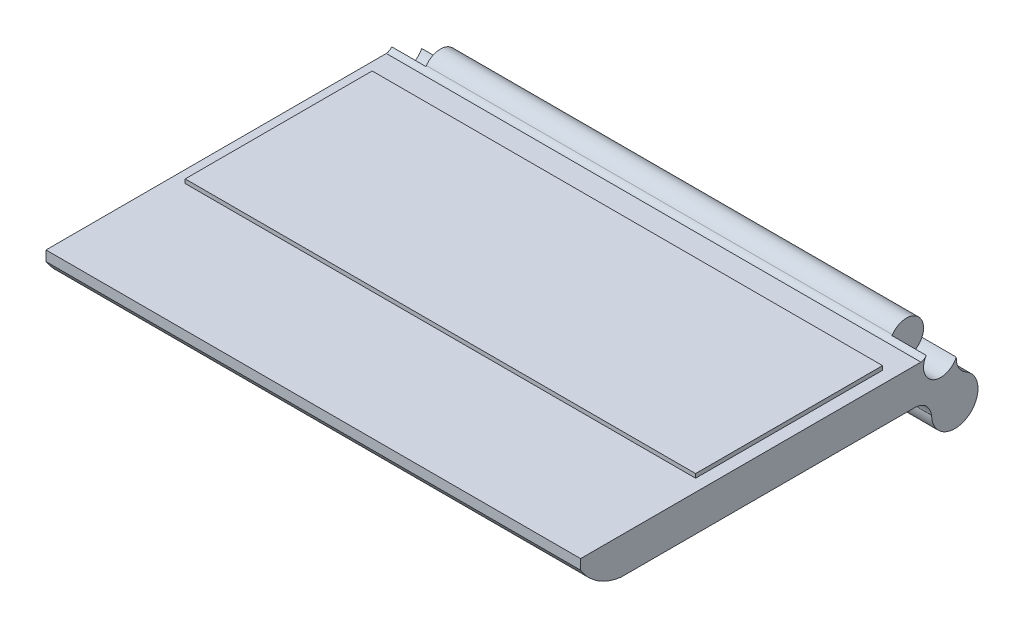
ISO-10303-21;
HEADER;
FILE_DESCRIPTION(('STEP AP214'),'2;1');
FILE_NAME('part.step','',(''),(''),'','','');
FILE_SCHEMA(('AUTOMOTIVE_DESIGN { 1 0 10303 214 1 1 1 1 }'));
ENDSEC;
DATA;
#1=APPLICATION_CONTEXT('core data for automotive mechanical design processes');
#2=APPLICATION_PROTOCOL_DEFINITION('international standard','automotive_design',2000,#1);
#3=PRODUCT_CONTEXT('',#1,'mechanical');
#4=PRODUCT('Part','Part','',(#3));
#5=PRODUCT_RELATED_PRODUCT_CATEGORY('part','',(#4));
#6=PRODUCT_DEFINITION_FORMATION('','',#4);
#7=PRODUCT_DEFINITION_CONTEXT('part definition',#1,'design');
#8=PRODUCT_DEFINITION('design','',#6,#7);
#9=PRODUCT_DEFINITION_SHAPE('','',#8);
#10=(LENGTH_UNIT() NAMED_UNIT(*) SI_UNIT(.MILLI.,.METRE.));
#11=(NAMED_UNIT(*) PLANE_ANGLE_UNIT() SI_UNIT($,.RADIAN.));
#12=(NAMED_UNIT(*) SI_UNIT($,.STERADIAN.) SOLID_ANGLE_UNIT());
#13=UNCERTAINTY_MEASURE_WITH_UNIT(LENGTH_MEASURE(1.E-05),#10,'distance_accuracy_value','');
#14=(GEOMETRIC_REPRESENTATION_CONTEXT(3) GLOBAL_UNCERTAINTY_ASSIGNED_CONTEXT((#13)) GLOBAL_UNIT_ASSIGNED_CONTEXT((#10,
#11,#12)) REPRESENTATION_CONTEXT('',''));
#15=CARTESIAN_POINT('',(0.,0.,0.));
#16=DIRECTION('',(0.,0.,1.));
#17=DIRECTION('',(1.,0.,0.));
#18=AXIS2_PLACEMENT_3D('',#15,#16,#17);
#19=CARTESIAN_POINT('',(132.5,15.,-93.5));
#20=DIRECTION('',(-1.,0.,0.));
#21=DIRECTION('',(0.,0.,1.));
#22=AXIS2_PLACEMENT_3D('',#19,#20,#21);
#23=CYLINDRICAL_SURFACE('',#22,8.50000000000001);
#24=DIRECTION('',(-1.,0.,0.));
#25=VECTOR('',#24,1.);
#26=CARTESIAN_POINT('',(132.5,19.8783276679257,-86.5392587201972));
#27=LINE('',#26,#25);
#28=CARTESIAN_POINT('',(115.5,19.8783276679257,-86.5392587201972));
#29=VERTEX_POINT('',#28);
#30=CARTESIAN_POINT('',(-115.5,19.8783276679257,-86.5392587201972));
#31=VERTEX_POINT('',#30);
#32=EDGE_CURVE('E179',#29,#31,#27,.T.);
#33=ORIENTED_EDGE('',*,*,#32,.F.);
#34=CARTESIAN_POINT('',(115.5,15.,-93.5));
#35=DIRECTION('',(-1.,0.,0.));
#36=DIRECTION('',(0.,0.,1.));
#37=AXIS2_PLACEMENT_3D('',#34,#35,#36);
#38=CIRCLE('',#37,8.50000000000001);
#39=CARTESIAN_POINT('',(115.5,11.408094152009,-101.203779097246));
#40=VERTEX_POINT('',#39);
#41=EDGE_CURVE('E390',#29,#40,#38,.T.);
#42=ORIENTED_EDGE('',*,*,#41,.T.);
#43=DIRECTION('',(-1.,0.,0.));
#44=VECTOR('',#43,1.);
#45=CARTESIAN_POINT('',(132.5,11.408094152009,-101.203779097246));
#46=LINE('',#45,#44);
#47=CARTESIAN_POINT('',(-115.5,11.408094152009,-101.203779097246));
#48=VERTEX_POINT('',#47);
#49=EDGE_CURVE('E52',#40,#48,#46,.T.);
#50=ORIENTED_EDGE('',*,*,#49,.T.);
#51=CARTESIAN_POINT('',(-115.5,15.,-93.5));
#52=DIRECTION('',(-1.,0.,0.));
#53=DIRECTION('',(0.,0.,1.));
#54=AXIS2_PLACEMENT_3D('',#51,#52,#53);
#55=CIRCLE('',#54,8.50000000000001);
#56=EDGE_CURVE('E391',#31,#48,#55,.T.);
#57=ORIENTED_EDGE('',*,*,#56,.F.);
#58=EDGE_LOOP('',(#33,#42,#50,#57));
#59=FACE_BOUND('',#58,.T.);
#60=ADVANCED_FACE('F33',(#59),#23,.T.);
#61=CARTESIAN_POINT('',(132.5,18.,85.));
#62=DIRECTION('',(-1.,0.,0.));
#63=DIRECTION('',(0.,0.,1.));
#64=AXIS2_PLACEMENT_3D('',#61,#62,#63);
#65=PLANE('',#64);
#66=CARTESIAN_POINT('',(132.5,15.,-93.5));
#67=DIRECTION('',(-1.,0.,0.));
#68=DIRECTION('',(0.,0.,1.));
#69=AXIS2_PLACEMENT_3D('',#66,#67,#68);
#70=CIRCLE('',#69,8.50000000000001);
#71=CARTESIAN_POINT('',(132.5,11.408094152009,-101.203779097246));
#72=VERTEX_POINT('',#71);
#73=CARTESIAN_POINT('',(132.5,19.5684800421352,-86.3320860702285));
#74=VERTEX_POINT('',#73);
#75=EDGE_CURVE('E153',#72,#74,#70,.T.);
#76=ORIENTED_EDGE('',*,*,#75,.T.);
#77=CARTESIAN_POINT('',(132.5,19.8783276679257,-86.5392587201972));
#78=CARTESIAN_POINT('',(132.5,17.7202429654045,-85.2085533477742));
#79=CARTESIAN_POINT('',(132.5,18.,-82.512998719724));
#80=B_SPLINE_CURVE_WITH_KNOTS('',2,(#77,#78,#79),.UNSPECIFIED.,.F.,.F.,(3,3),(0.,1.),.UNSPECIFIED.);
#81=CARTESIAN_POINT('',(132.5,18.,-83.6784287243484));
#82=VERTEX_POINT('',#81);
#83=EDGE_CURVE('E166',#74,#82,#80,.T.);
#84=ORIENTED_EDGE('',*,*,#83,.T.);
#85=DIRECTION('',(0.,0.,-1.));
#86=VECTOR('',#85,1.);
#87=CARTESIAN_POINT('',(132.5,18.,85.));
#88=LINE('',#87,#86);
#89=CARTESIAN_POINT('',(132.5,18.,85.));
#90=VERTEX_POINT('',#89);
#91=EDGE_CURVE('E233',#90,#82,#88,.T.);
#92=ORIENTED_EDGE('',*,*,#91,.F.);
#93=DIRECTION('',(0.,-1.,0.));
#94=VECTOR('',#93,1.);
#95=CARTESIAN_POINT('',(132.5,18.,85.));
#96=LINE('',#95,#94);
#97=CARTESIAN_POINT('',(132.5,13.,85.));
#98=VERTEX_POINT('',#97);
#99=EDGE_CURVE('E240',#90,#98,#96,.T.);
#100=ORIENTED_EDGE('',*,*,#99,.T.);
#101=CARTESIAN_POINT('',(132.5,27.1088926371398,61.6042197858591));
#102=DIRECTION('',(-1.,0.,0.));
#103=DIRECTION('',(0.,0.,1.));
#104=AXIS2_PLACEMENT_3D('',#101,#102,#103);
#105=CIRCLE('',#104,27.3207500496367);
#106=CARTESIAN_POINT('',(132.5,0.,65.));
#107=VERTEX_POINT('',#106);
#108=EDGE_CURVE('E227',#98,#107,#105,.F.);
#109=ORIENTED_EDGE('',*,*,#108,.T.);
#110=DIRECTION('',(0.,0.,-1.));
#111=VECTOR('',#110,1.);
#112=CARTESIAN_POINT('',(132.5,0.,85.));
#113=LINE('',#112,#111);
#114=CARTESIAN_POINT('',(132.5,2.78911144397168E-10,-80.9560981290784));
#115=VERTEX_POINT('',#114);
#116=EDGE_CURVE('E232',#107,#115,#113,.T.);
#117=ORIENTED_EDGE('',*,*,#116,.T.);
#118=CARTESIAN_POINT('',(132.5,-7.5,-89.));
#119=CARTESIAN_POINT('',(132.5,0.615126939245119,-87.2365411156149));
#120=CARTESIAN_POINT('',(132.5,0.,-78.6792495373291));
#121=B_SPLINE_CURVE_WITH_KNOTS('',2,(#118,#119,#120),.UNSPECIFIED.,.F.,.F.,(3,3),(0.,1.),.UNSPECIFIED.);
#122=CARTESIAN_POINT('',(132.5,-7.5,-89.));
#123=VERTEX_POINT('',#122);
#124=EDGE_CURVE('E302',#123,#115,#121,.T.);
#125=ORIENTED_EDGE('',*,*,#124,.F.);
#126=CARTESIAN_POINT('',(132.5,-7.5,-100.5));
#127=DIRECTION('',(-1.,0.,0.));
#128=DIRECTION('',(0.,0.,1.));
#129=AXIS2_PLACEMENT_3D('',#126,#127,#128);
#130=CIRCLE('',#129,11.5);
#131=CARTESIAN_POINT('',(132.5,2.59662687275054,-106.005281626988));
#132=VERTEX_POINT('',#131);
#133=EDGE_CURVE('E301',#132,#123,#130,.T.);
#134=ORIENTED_EDGE('',*,*,#133,.F.);
#135=CARTESIAN_POINT('',(132.5,2.59662687275054,-106.005281626988));
#136=CARTESIAN_POINT('',(132.5,5.73796552227805,-101.037094556743));
#137=CARTESIAN_POINT('',(132.5,11.408094152009,-101.203779097246));
#138=B_SPLINE_CURVE_WITH_KNOTS('',2,(#135,#136,#137),.UNSPECIFIED.,.F.,.F.,(3,3),(0.,1.),.UNSPECIFIED.);
#139=EDGE_CURVE('E170',#132,#72,#138,.T.);
#140=ORIENTED_EDGE('',*,*,#139,.T.);
#141=EDGE_LOOP('',(#76,#84,#92,#100,#109,#117,#125,#134,#140));
#142=FACE_BOUND('',#141,.T.);
#143=ADVANCED_FACE('F35',(#142),#65,.F.);
#144=DIRECTION('',(-1.,0.,0.));
#145=VECTOR('',#144,1.);
#146=SURFACE_OF_LINEAR_EXTRUSION('',#80,#145);
#147=DIRECTION('',(-1.,0.,0.));
#148=VECTOR('',#147,1.);
#149=CARTESIAN_POINT('',(132.5,19.5684800421352,-86.3320860702285));
#150=LINE('',#149,#148);
#151=CARTESIAN_POINT('',(115.5,19.5684800421352,-86.3320860702285));
#152=VERTEX_POINT('',#151);
#153=EDGE_CURVE('E150',#152,#74,#150,.F.);
#154=ORIENTED_EDGE('',*,*,#153,.F.);
#155=CARTESIAN_POINT('',(115.5,19.5684800421352,-86.3320860702285));
#156=CARTESIAN_POINT('',(115.5,19.7165544682594,-86.4395070905885));
#157=CARTESIAN_POINT('',(115.5,19.8783276679257,-86.5392587201972));
#158=B_SPLINE_CURVE_WITH_KNOTS('',2,(#155,#156,#157),.UNSPECIFIED.,.F.,.F.,(3,3),(0.,
0.0749614690643767),.UNSPECIFIED.);
#159=EDGE_CURVE('E162',#152,#29,#158,.T.);
#160=ORIENTED_EDGE('',*,*,#159,.T.);
#161=ORIENTED_EDGE('',*,*,#32,.T.);
#162=CARTESIAN_POINT('',(-115.5,19.8783276679257,-86.5392587201972));
#163=CARTESIAN_POINT('',(-115.5,19.7165544682594,-86.4395070905885));
#164=CARTESIAN_POINT('',(-115.5,19.5684800421351,-86.3320860702285));
#165=B_SPLINE_CURVE_WITH_KNOTS('',2,(#162,#163,#164),.UNSPECIFIED.,.F.,.F.,(3,3),(0.,
0.0749614690643824),.UNSPECIFIED.);
#166=CARTESIAN_POINT('',(-115.5,19.5684800421351,-86.3320860702285));
#167=VERTEX_POINT('',#166);
#168=EDGE_CURVE('E257',#167,#31,#165,.F.);
#169=ORIENTED_EDGE('',*,*,#168,.F.);
#170=DIRECTION('',(-1.,0.,0.));
#171=VECTOR('',#170,1.);
#172=CARTESIAN_POINT('',(132.5,19.5684800421352,-86.3320860702285));
#173=LINE('',#172,#171);
#174=CARTESIAN_POINT('',(-132.5,19.5684800421351,-86.3320860702285));
#175=VERTEX_POINT('',#174);
#176=EDGE_CURVE('E252',#167,#175,#173,.T.);
#177=ORIENTED_EDGE('',*,*,#176,.T.);
#178=CARTESIAN_POINT('',(-132.5,19.8783276679257,-86.5392587201972));
#179=CARTESIAN_POINT('',(-132.5,17.7202429654045,-85.2085533477742));
#180=CARTESIAN_POINT('',(-132.5,18.,-82.512998719724));
#181=B_SPLINE_CURVE_WITH_KNOTS('',2,(#178,#179,#180),.UNSPECIFIED.,.F.,.F.,(3,3),(0.,1.),.UNSPECIFIED.);
#182=CARTESIAN_POINT('',(-132.5,18.,-83.6784287243484));
#183=VERTEX_POINT('',#182);
#184=EDGE_CURVE('E177',#175,#183,#181,.T.);
#185=ORIENTED_EDGE('',*,*,#184,.T.);
#186=DIRECTION('',(-1.,0.,0.));
#187=VECTOR('',#186,1.);
#188=CARTESIAN_POINT('',(132.5,18.,-83.6784287243484));
#189=LINE('',#188,#187);
#190=EDGE_CURVE('E176',#82,#183,#189,.T.);
#191=ORIENTED_EDGE('',*,*,#190,.F.);
#192=ORIENTED_EDGE('',*,*,#83,.F.);
#193=EDGE_LOOP('',(#154,#160,#161,#169,#177,#185,#191,#192));
#194=FACE_BOUND('',#193,.T.);
#195=ADVANCED_FACE('F174',(#194),#146,.F.);
#196=CARTESIAN_POINT('',(132.5,18.,-85.));
#197=DIRECTION('',(0.,-1.,0.));
#198=DIRECTION('',(0.,0.,-1.));
#199=AXIS2_PLACEMENT_3D('',#196,#197,#198);
#200=PLANE('',#199);
#201=ORIENTED_EDGE('',*,*,#190,.T.);
#202=DIRECTION('',(0.,0.,1.));
#203=VECTOR('',#202,1.);
#204=CARTESIAN_POINT('',(-132.5,18.,85.));
#205=LINE('',#204,#203);
#206=CARTESIAN_POINT('',(-132.5,18.,85.));
#207=VERTEX_POINT('',#206);
#208=EDGE_CURVE('E235',#183,#207,#205,.T.);
#209=ORIENTED_EDGE('',*,*,#208,.T.);
#210=DIRECTION('',(1.,0.,0.));
#211=VECTOR('',#210,1.);
#212=CARTESIAN_POINT('',(-132.5,18.,85.));
#213=LINE('',#212,#211);
#214=EDGE_CURVE('E238',#207,#90,#213,.T.);
#215=ORIENTED_EDGE('',*,*,#214,.T.);
#216=ORIENTED_EDGE('',*,*,#91,.T.);
#217=EDGE_LOOP('',(#201,#209,#215,#216));
#218=FACE_BOUND('',#217,.T.);
#219=DIRECTION('',(0.,0.,1.));
#220=VECTOR('',#219,1.);
#221=CARTESIAN_POINT('',(-126.5,18.,22.));
#222=LINE('',#221,#220);
#223=CARTESIAN_POINT('',(-126.5,18.,-70.6784287243484));
#224=VERTEX_POINT('',#223);
#225=CARTESIAN_POINT('',(-126.5,18.,22.));
#226=VERTEX_POINT('',#225);
#227=EDGE_CURVE('E332',#224,#226,#222,.T.);
#228=ORIENTED_EDGE('',*,*,#227,.F.);
#229=DIRECTION('',(-1.,0.,0.));
#230=VECTOR('',#229,1.);
#231=CARTESIAN_POINT('',(126.5,18.,-70.6784287243484));
#232=LINE('',#231,#230);
#233=CARTESIAN_POINT('',(126.5,18.,-70.6784287243484));
#234=VERTEX_POINT('',#233);
#235=EDGE_CURVE('E341',#234,#224,#232,.T.);
#236=ORIENTED_EDGE('',*,*,#235,.F.);
#237=DIRECTION('',(0.,0.,-1.));
#238=VECTOR('',#237,1.);
#239=CARTESIAN_POINT('',(126.5,18.,22.));
#240=LINE('',#239,#238);
#241=CARTESIAN_POINT('',(126.5,18.,22.));
#242=VERTEX_POINT('',#241);
#243=EDGE_CURVE('E351',#242,#234,#240,.T.);
#244=ORIENTED_EDGE('',*,*,#243,.F.);
#245=DIRECTION('',(1.,0.,0.));
#246=VECTOR('',#245,1.);
#247=CARTESIAN_POINT('',(126.5,18.,22.));
#248=LINE('',#247,#246);
#249=EDGE_CURVE('E60',#226,#242,#248,.T.);
#250=ORIENTED_EDGE('',*,*,#249,.F.);
#251=EDGE_LOOP('',(#228,#236,#244,#250));
#252=FACE_BOUND('',#251,.T.);
#253=ADVANCED_FACE('F202',(#218,#252),#200,.F.);
#254=CARTESIAN_POINT('',(-132.5,18.,85.));
#255=DIRECTION('',(1.,0.,0.));
#256=DIRECTION('',(0.,0.,-1.));
#257=AXIS2_PLACEMENT_3D('',#254,#255,#256);
#258=PLANE('',#257);
#259=ORIENTED_EDGE('',*,*,#184,.F.);
#260=CARTESIAN_POINT('',(-132.5,15.,-93.5));
#261=DIRECTION('',(-1.,0.,0.));
#262=DIRECTION('',(0.,0.,1.));
#263=AXIS2_PLACEMENT_3D('',#260,#261,#262);
#264=CIRCLE('',#263,8.50000000000001);
#265=CARTESIAN_POINT('',(-132.5,11.408094152009,-101.203779097246));
#266=VERTEX_POINT('',#265);
#267=EDGE_CURVE('E161',#266,#175,#264,.T.);
#268=ORIENTED_EDGE('',*,*,#267,.F.);
#269=CARTESIAN_POINT('',(-132.5,2.59662687275054,-106.005281626988));
#270=CARTESIAN_POINT('',(-132.5,5.73796552227805,-101.037094556743));
#271=CARTESIAN_POINT('',(-132.5,11.408094152009,-101.203779097246));
#272=B_SPLINE_CURVE_WITH_KNOTS('',2,(#269,#270,#271),.UNSPECIFIED.,.F.,.F.,(3,3),(0.,1.),.UNSPECIFIED.);
#273=CARTESIAN_POINT('',(-132.5,2.59662687275054,-106.005281626988));
#274=VERTEX_POINT('',#273);
#275=EDGE_CURVE('E316',#274,#266,#272,.T.);
#276=ORIENTED_EDGE('',*,*,#275,.F.);
#277=CARTESIAN_POINT('',(-132.5,-7.5,-100.5));
#278=DIRECTION('',(-1.,0.,0.));
#279=DIRECTION('',(0.,0.,1.));
#280=AXIS2_PLACEMENT_3D('',#277,#278,#279);
#281=CIRCLE('',#280,11.5);
#282=CARTESIAN_POINT('',(-132.5,-7.5,-89.));
#283=VERTEX_POINT('',#282);
#284=EDGE_CURVE('E324',#274,#283,#281,.T.);
#285=ORIENTED_EDGE('',*,*,#284,.T.);
#286=CARTESIAN_POINT('',(-132.5,-7.5,-89.));
#287=CARTESIAN_POINT('',(-132.5,0.615126939245119,-87.2365411156149));
#288=CARTESIAN_POINT('',(-132.5,0.,-78.6792495373291));
#289=B_SPLINE_CURVE_WITH_KNOTS('',2,(#286,#287,#288),.UNSPECIFIED.,.F.,.F.,(3,3),(0.,1.),.UNSPECIFIED.);
#290=CARTESIAN_POINT('',(-132.5,2.78911144397168E-10,-80.9560981290784));
#291=VERTEX_POINT('',#290);
#292=EDGE_CURVE('E256',#283,#291,#289,.T.);
#293=ORIENTED_EDGE('',*,*,#292,.T.);
#294=DIRECTION('',(0.,0.,1.));
#295=VECTOR('',#294,1.);
#296=CARTESIAN_POINT('',(-132.5,0.,85.));
#297=LINE('',#296,#295);
#298=CARTESIAN_POINT('',(-132.5,0.,65.));
#299=VERTEX_POINT('',#298);
#300=EDGE_CURVE('E236',#291,#299,#297,.T.);
#301=ORIENTED_EDGE('',*,*,#300,.T.);
#302=CARTESIAN_POINT('',(-132.5,27.1088926371398,61.6042197858591));
#303=DIRECTION('',(1.,0.,0.));
#304=DIRECTION('',(0.,0.,-1.));
#305=AXIS2_PLACEMENT_3D('',#302,#303,#304);
#306=CIRCLE('',#305,27.3207500496367);
#307=CARTESIAN_POINT('',(-132.5,13.,85.));
#308=VERTEX_POINT('',#307);
#309=EDGE_CURVE('E222',#299,#308,#306,.F.);
#310=ORIENTED_EDGE('',*,*,#309,.T.);
#311=DIRECTION('',(0.,-1.,0.));
#312=VECTOR('',#311,1.);
#313=CARTESIAN_POINT('',(-132.5,18.,85.));
#314=LINE('',#313,#312);
#315=EDGE_CURVE('E245',#207,#308,#314,.T.);
#316=ORIENTED_EDGE('',*,*,#315,.F.);
#317=ORIENTED_EDGE('',*,*,#208,.F.);
#318=EDGE_LOOP('',(#259,#268,#276,#285,#293,#301,#310,#316,#317));
#319=FACE_BOUND('',#318,.T.);
#320=ADVANCED_FACE('F501',(#319),#258,.F.);
#321=CARTESIAN_POINT('',(-132.5,18.,85.));
#322=DIRECTION('',(0.,0.,-1.));
#323=DIRECTION('',(-1.,0.,0.));
#324=AXIS2_PLACEMENT_3D('',#321,#322,#323);
#325=PLANE('',#324);
#326=ORIENTED_EDGE('',*,*,#315,.T.);
#327=DIRECTION('',(-1.,0.,0.));
#328=VECTOR('',#327,1.);
#329=CARTESIAN_POINT('',(526.694193894329,13.,85.));
#330=LINE('',#329,#328);
#331=EDGE_CURVE('E218',#98,#308,#330,.T.);
#332=ORIENTED_EDGE('',*,*,#331,.F.);
#333=ORIENTED_EDGE('',*,*,#99,.F.);
#334=ORIENTED_EDGE('',*,*,#214,.F.);
#335=EDGE_LOOP('',(#326,#332,#333,#334));
#336=FACE_BOUND('',#335,.T.);
#337=ADVANCED_FACE('F452',(#336),#325,.F.);
#338=CARTESIAN_POINT('',(132.5,0.,-85.));
#339=DIRECTION('',(0.,-1.,0.));
#340=DIRECTION('',(0.,0.,-1.));
#341=AXIS2_PLACEMENT_3D('',#338,#339,#340);
#342=PLANE('',#341);
#343=DIRECTION('',(-1.,0.,0.));
#344=VECTOR('',#343,1.);
#345=CARTESIAN_POINT('',(132.5,0.,-80.9560981325244));
#346=LINE('',#345,#344);
#347=EDGE_CURVE('E11',#115,#291,#346,.T.);
#348=ORIENTED_EDGE('',*,*,#347,.F.);
#349=ORIENTED_EDGE('',*,*,#116,.F.);
#350=DIRECTION('',(-1.,0.,0.));
#351=VECTOR('',#350,1.);
#352=CARTESIAN_POINT('',(526.694193894329,0.,65.));
#353=LINE('',#352,#351);
#354=EDGE_CURVE('E44',#299,#107,#353,.F.);
#355=ORIENTED_EDGE('',*,*,#354,.F.);
#356=ORIENTED_EDGE('',*,*,#300,.F.);
#357=EDGE_LOOP('',(#348,#349,#355,#356));
#358=FACE_BOUND('',#357,.T.);
#359=ADVANCED_FACE('F448',(#358),#342,.T.);
#360=CARTESIAN_POINT('',(526.694193894329,27.1088926371398,61.6042197858591));
#361=DIRECTION('',(-1.,0.,0.));
#362=DIRECTION('',(0.,0.,1.));
#363=AXIS2_PLACEMENT_3D('',#360,#361,#362);
#364=CYLINDRICAL_SURFACE('',#363,27.3207500496367);
#365=ORIENTED_EDGE('',*,*,#108,.F.);
#366=ORIENTED_EDGE('',*,*,#331,.T.);
#367=ORIENTED_EDGE('',*,*,#309,.F.);
#368=ORIENTED_EDGE('',*,*,#354,.T.);
#369=EDGE_LOOP('',(#365,#366,#367,#368));
#370=FACE_BOUND('',#369,.T.);
#371=ADVANCED_FACE('F204',(#370),#364,.T.);
#372=CARTESIAN_POINT('',(-126.5,20.,22.));
#373=DIRECTION('',(1.,0.,0.));
#374=DIRECTION('',(0.,0.,-1.));
#375=AXIS2_PLACEMENT_3D('',#372,#373,#374);
#376=PLANE('',#375);
#377=ORIENTED_EDGE('',*,*,#227,.T.);
#378=DIRECTION('',(0.,-1.,0.));
#379=VECTOR('',#378,1.);
#380=CARTESIAN_POINT('',(-126.5,20.,22.));
#381=LINE('',#380,#379);
#382=CARTESIAN_POINT('',(-126.5,20.,22.));
#383=VERTEX_POINT('',#382);
#384=EDGE_CURVE('E181',#383,#226,#381,.T.);
#385=ORIENTED_EDGE('',*,*,#384,.F.);
#386=DIRECTION('',(0.,0.,1.));
#387=VECTOR('',#386,1.);
#388=CARTESIAN_POINT('',(-126.5,20.,22.));
#389=LINE('',#388,#387);
#390=CARTESIAN_POINT('',(-126.5,20.,-70.6784287243484));
#391=VERTEX_POINT('',#390);
#392=EDGE_CURVE('E337',#391,#383,#389,.T.);
#393=ORIENTED_EDGE('',*,*,#392,.F.);
#394=DIRECTION('',(0.,-1.,0.));
#395=VECTOR('',#394,1.);
#396=CARTESIAN_POINT('',(-126.5,20.,-70.6784287243484));
#397=LINE('',#396,#395);
#398=EDGE_CURVE('E347',#391,#224,#397,.T.);
#399=ORIENTED_EDGE('',*,*,#398,.T.);
#400=EDGE_LOOP('',(#377,#385,#393,#399));
#401=FACE_BOUND('',#400,.T.);
#402=ADVANCED_FACE('F370',(#401),#376,.F.);
#403=CARTESIAN_POINT('',(126.5,20.,22.));
#404=DIRECTION('',(0.,0.,-1.));
#405=DIRECTION('',(-1.,0.,0.));
#406=AXIS2_PLACEMENT_3D('',#403,#404,#405);
#407=PLANE('',#406);
#408=ORIENTED_EDGE('',*,*,#249,.T.);
#409=DIRECTION('',(0.,-1.,0.));
#410=VECTOR('',#409,1.);
#411=CARTESIAN_POINT('',(126.5,20.,22.));
#412=LINE('',#411,#410);
#413=CARTESIAN_POINT('',(126.5,20.,22.));
#414=VERTEX_POINT('',#413);
#415=EDGE_CURVE('E360',#414,#242,#412,.T.);
#416=ORIENTED_EDGE('',*,*,#415,.F.);
#417=DIRECTION('',(1.,0.,0.));
#418=VECTOR('',#417,1.);
#419=CARTESIAN_POINT('',(126.5,20.,22.));
#420=LINE('',#419,#418);
#421=EDGE_CURVE('E340',#383,#414,#420,.T.);
#422=ORIENTED_EDGE('',*,*,#421,.F.);
#423=ORIENTED_EDGE('',*,*,#384,.T.);
#424=EDGE_LOOP('',(#408,#416,#422,#423));
#425=FACE_BOUND('',#424,.T.);
#426=ADVANCED_FACE('F367',(#425),#407,.F.);
#427=CARTESIAN_POINT('',(126.5,20.,22.));
#428=DIRECTION('',(-1.,0.,0.));
#429=DIRECTION('',(0.,0.,1.));
#430=AXIS2_PLACEMENT_3D('',#427,#428,#429);
#431=PLANE('',#430);
#432=ORIENTED_EDGE('',*,*,#243,.T.);
#433=DIRECTION('',(0.,-1.,0.));
#434=VECTOR('',#433,1.);
#435=CARTESIAN_POINT('',(126.5,20.,-70.6784287243484));
#436=LINE('',#435,#434);
#437=CARTESIAN_POINT('',(126.5,20.,-70.6784287243484));
#438=VERTEX_POINT('',#437);
#439=EDGE_CURVE('E358',#438,#234,#436,.T.);
#440=ORIENTED_EDGE('',*,*,#439,.F.);
#441=DIRECTION('',(0.,0.,-1.));
#442=VECTOR('',#441,1.);
#443=CARTESIAN_POINT('',(126.5,20.,22.));
#444=LINE('',#443,#442);
#445=EDGE_CURVE('E343',#414,#438,#444,.T.);
#446=ORIENTED_EDGE('',*,*,#445,.F.);
#447=ORIENTED_EDGE('',*,*,#415,.T.);
#448=EDGE_LOOP('',(#432,#440,#446,#447));
#449=FACE_BOUND('',#448,.T.);
#450=ADVANCED_FACE('F376',(#449),#431,.F.);
#451=CARTESIAN_POINT('',(126.5,20.,-70.6784287243484));
#452=DIRECTION('',(0.,0.,1.));
#453=DIRECTION('',(1.,0.,0.));
#454=AXIS2_PLACEMENT_3D('',#451,#452,#453);
#455=PLANE('',#454);
#456=ORIENTED_EDGE('',*,*,#235,.T.);
#457=ORIENTED_EDGE('',*,*,#398,.F.);
#458=DIRECTION('',(-1.,0.,0.));
#459=VECTOR('',#458,1.);
#460=CARTESIAN_POINT('',(126.5,20.,-70.6784287243484));
#461=LINE('',#460,#459);
#462=EDGE_CURVE('E345',#438,#391,#461,.T.);
#463=ORIENTED_EDGE('',*,*,#462,.F.);
#464=ORIENTED_EDGE('',*,*,#439,.T.);
#465=EDGE_LOOP('',(#456,#457,#463,#464));
#466=FACE_BOUND('',#465,.T.);
#467=ADVANCED_FACE('F373',(#466),#455,.F.);
#468=CARTESIAN_POINT('',(-126.5,20.,-70.6784287243484));
#469=DIRECTION('',(0.,1.,0.));
#470=DIRECTION('',(0.,0.,1.));
#471=AXIS2_PLACEMENT_3D('',#468,#469,#470);
#472=PLANE('',#471);
#473=ORIENTED_EDGE('',*,*,#392,.T.);
#474=ORIENTED_EDGE('',*,*,#421,.T.);
#475=ORIENTED_EDGE('',*,*,#445,.T.);
#476=ORIENTED_EDGE('',*,*,#462,.T.);
#477=EDGE_LOOP('',(#473,#474,#475,#476));
#478=FACE_BOUND('',#477,.T.);
#479=ADVANCED_FACE('F378',(#478),#472,.T.);
#480=DIRECTION('',(-1.,0.,0.));
#481=VECTOR('',#480,1.);
#482=SURFACE_OF_LINEAR_EXTRUSION('',#121,#481);
#483=ORIENTED_EDGE('',*,*,#124,.T.);
#484=ORIENTED_EDGE('',*,*,#347,.T.);
#485=ORIENTED_EDGE('',*,*,#292,.F.);
#486=DIRECTION('',(-1.,0.,0.));
#487=VECTOR('',#486,1.);
#488=CARTESIAN_POINT('',(132.5,-7.5,-89.));
#489=LINE('',#488,#487);
#490=EDGE_CURVE('E330',#123,#283,#489,.T.);
#491=ORIENTED_EDGE('',*,*,#490,.F.);
#492=EDGE_LOOP('',(#483,#484,#485,#491));
#493=FACE_BOUND('',#492,.T.);
#494=ADVANCED_FACE('F289',(#493),#482,.T.);
#495=CARTESIAN_POINT('',(132.5,-7.5,-100.5));
#496=DIRECTION('',(-1.,0.,0.));
#497=DIRECTION('',(0.,0.,1.));
#498=AXIS2_PLACEMENT_3D('',#495,#496,#497);
#499=CYLINDRICAL_SURFACE('',#498,11.5);
#500=ORIENTED_EDGE('',*,*,#284,.F.);
#501=DIRECTION('',(-1.,0.,0.));
#502=VECTOR('',#501,1.);
#503=CARTESIAN_POINT('',(132.5,2.59662687275054,-106.005281626988));
#504=LINE('',#503,#502);
#505=EDGE_CURVE('E333',#132,#274,#504,.T.);
#506=ORIENTED_EDGE('',*,*,#505,.F.);
#507=ORIENTED_EDGE('',*,*,#133,.T.);
#508=ORIENTED_EDGE('',*,*,#490,.T.);
#509=EDGE_LOOP('',(#500,#506,#507,#508));
#510=FACE_BOUND('',#509,.T.);
#511=ADVANCED_FACE('F286',(#510),#499,.T.);
#512=DIRECTION('',(-1.,0.,0.));
#513=VECTOR('',#512,1.);
#514=SURFACE_OF_LINEAR_EXTRUSION('',#138,#513);
#515=ORIENTED_EDGE('',*,*,#275,.T.);
#516=EDGE_CURVE('E311',#48,#266,#46,.T.);
#517=ORIENTED_EDGE('',*,*,#516,.F.);
#518=ORIENTED_EDGE('',*,*,#49,.F.);
#519=EDGE_CURVE('E335',#72,#40,#46,.T.);
#520=ORIENTED_EDGE('',*,*,#519,.F.);
#521=ORIENTED_EDGE('',*,*,#139,.F.);
#522=ORIENTED_EDGE('',*,*,#505,.T.);
#523=EDGE_LOOP('',(#515,#517,#518,#520,#521,#522));
#524=FACE_BOUND('',#523,.T.);
#525=ADVANCED_FACE('F284',(#524),#514,.F.);
#526=CARTESIAN_POINT('',(-115.5,15.,-93.5));
#527=DIRECTION('',(-1.,0.,0.));
#528=DIRECTION('',(0.,0.,1.));
#529=AXIS2_PLACEMENT_3D('',#526,#527,#528);
#530=CYLINDRICAL_SURFACE('',#529,8.50000000000001);
#531=EDGE_CURVE('E261',#48,#167,#55,.T.);
#532=ORIENTED_EDGE('',*,*,#531,.F.);
#533=ORIENTED_EDGE('',*,*,#516,.T.);
#534=ORIENTED_EDGE('',*,*,#267,.T.);
#535=ORIENTED_EDGE('',*,*,#176,.F.);
#536=EDGE_LOOP('',(#532,#533,#534,#535));
#537=FACE_BOUND('',#536,.T.);
#538=ADVANCED_FACE('F280',(#537),#530,.F.);
#539=CARTESIAN_POINT('',(-115.5,15.,-93.5));
#540=DIRECTION('',(-1.,0.,0.));
#541=DIRECTION('',(0.,0.,1.));
#542=AXIS2_PLACEMENT_3D('',#539,#540,#541);
#543=PLANE('',#542);
#544=ORIENTED_EDGE('',*,*,#168,.T.);
#545=ORIENTED_EDGE('',*,*,#56,.T.);
#546=ORIENTED_EDGE('',*,*,#531,.T.);
#547=EDGE_LOOP('',(#544,#545,#546));
#548=FACE_BOUND('',#547,.T.);
#549=ADVANCED_FACE('F270',(#548),#543,.T.);
#550=CARTESIAN_POINT('',(115.5,15.,-93.5));
#551=DIRECTION('',(1.,0.,0.));
#552=DIRECTION('',(0.,0.,-1.));
#553=AXIS2_PLACEMENT_3D('',#550,#551,#552);
#554=CYLINDRICAL_SURFACE('',#553,8.50000000000001);
#555=ORIENTED_EDGE('',*,*,#153,.T.);
#556=ORIENTED_EDGE('',*,*,#75,.F.);
#557=ORIENTED_EDGE('',*,*,#519,.T.);
#558=EDGE_CURVE('E156',#40,#152,#38,.T.);
#559=ORIENTED_EDGE('',*,*,#558,.T.);
#560=EDGE_LOOP('',(#555,#556,#557,#559));
#561=FACE_BOUND('',#560,.T.);
#562=ADVANCED_FACE('F152',(#561),#554,.F.);
#563=CARTESIAN_POINT('',(115.5,15.,-93.5));
#564=DIRECTION('',(1.,0.,0.));
#565=DIRECTION('',(0.,0.,1.));
#566=AXIS2_PLACEMENT_3D('',#563,#564,#565);
#567=PLANE('',#566);
#568=ORIENTED_EDGE('',*,*,#159,.F.);
#569=ORIENTED_EDGE('',*,*,#558,.F.);
#570=ORIENTED_EDGE('',*,*,#41,.F.);
#571=EDGE_LOOP('',(#568,#569,#570));
#572=FACE_BOUND('',#571,.T.);
#573=ADVANCED_FACE('F407',(#572),#567,.T.);
#574=CLOSED_SHELL('',(#60,#143,#195,#253,#320,#337,#359,#371,#402,#426,#450,#467,#479,#494,#511,
#525,#538,#549,#562,#573));
#575=MANIFOLD_SOLID_BREP('B2',#574);
#576=ADVANCED_BREP_SHAPE_REPRESENTATION('',(#18,#575),#14);
#577=SHAPE_DEFINITION_REPRESENTATION(#9,#576);
ENDSEC;
END-ISO-10303-21;
